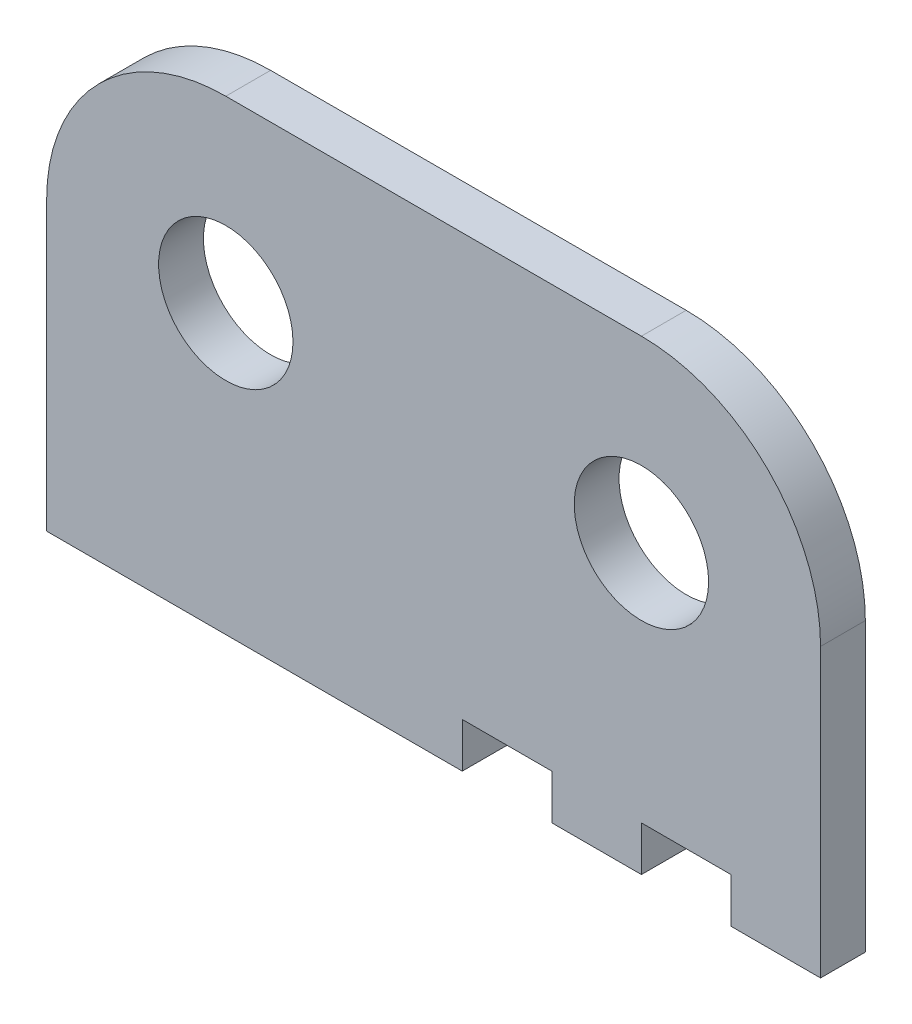
ISO-10303-21;
HEADER;
FILE_DESCRIPTION(('STEP AP214'),'2;1');
FILE_NAME('part.step','',(''),(''),'','','');
FILE_SCHEMA(('AUTOMOTIVE_DESIGN { 1 0 10303 214 1 1 1 1 }'));
ENDSEC;
DATA;
#1=APPLICATION_CONTEXT('core data for automotive mechanical design processes');
#2=APPLICATION_PROTOCOL_DEFINITION('international standard','automotive_design',2000,#1);
#3=PRODUCT_CONTEXT('',#1,'mechanical');
#4=PRODUCT('Part','Part','',(#3));
#5=PRODUCT_RELATED_PRODUCT_CATEGORY('part','',(#4));
#6=PRODUCT_DEFINITION_FORMATION('','',#4);
#7=PRODUCT_DEFINITION_CONTEXT('part definition',#1,'design');
#8=PRODUCT_DEFINITION('design','',#6,#7);
#9=PRODUCT_DEFINITION_SHAPE('','',#8);
#10=(LENGTH_UNIT() NAMED_UNIT(*) SI_UNIT(.MILLI.,.METRE.));
#11=(NAMED_UNIT(*) PLANE_ANGLE_UNIT() SI_UNIT($,.RADIAN.));
#12=(NAMED_UNIT(*) SI_UNIT($,.STERADIAN.) SOLID_ANGLE_UNIT());
#13=UNCERTAINTY_MEASURE_WITH_UNIT(LENGTH_MEASURE(1.E-05),#10,'distance_accuracy_value','');
#14=(GEOMETRIC_REPRESENTATION_CONTEXT(3) GLOBAL_UNCERTAINTY_ASSIGNED_CONTEXT((#13)) GLOBAL_UNIT_ASSIGNED_CONTEXT((#10,
#11,#12)) REPRESENTATION_CONTEXT('',''));
#15=CARTESIAN_POINT('',(0.,0.,0.));
#16=DIRECTION('',(0.,0.,1.));
#17=DIRECTION('',(1.,0.,0.));
#18=AXIS2_PLACEMENT_3D('',#15,#16,#17);
#19=CARTESIAN_POINT('',(-21.4763243575419,0.,3.175));
#20=DIRECTION('',(0.,1.,0.));
#21=DIRECTION('',(0.,0.,1.));
#22=AXIS2_PLACEMENT_3D('',#19,#20,#21);
#23=PLANE('',#22);
#24=DIRECTION('',(1.,0.,0.));
#25=VECTOR('',#24,1.);
#26=CARTESIAN_POINT('',(-21.4763243575419,0.,0.));
#27=LINE('',#26,#25);
#28=CARTESIAN_POINT('',(14.3376756424581,0.,0.));
#29=VERTEX_POINT('',#28);
#30=CARTESIAN_POINT('',(20.6876756424581,0.,0.));
#31=VERTEX_POINT('',#30);
#32=EDGE_CURVE('E285',#29,#31,#27,.T.);
#33=ORIENTED_EDGE('',*,*,#32,.T.);
#34=DIRECTION('',(0.,0.,-1.));
#35=VECTOR('',#34,1.);
#36=CARTESIAN_POINT('',(20.6876756424581,0.,0.));
#37=LINE('',#36,#35);
#38=CARTESIAN_POINT('',(20.6876756424581,0.,3.175));
#39=VERTEX_POINT('',#38);
#40=EDGE_CURVE('E150',#39,#31,#37,.T.);
#41=ORIENTED_EDGE('',*,*,#40,.F.);
#42=DIRECTION('',(1.,0.,0.));
#43=VECTOR('',#42,1.);
#44=CARTESIAN_POINT('',(-21.4763243575419,0.,3.175));
#45=LINE('',#44,#43);
#46=CARTESIAN_POINT('',(14.3376756424581,0.,3.175));
#47=VERTEX_POINT('',#46);
#48=EDGE_CURVE('E264',#47,#39,#45,.T.);
#49=ORIENTED_EDGE('',*,*,#48,.F.);
#50=DIRECTION('',(0.,0.,1.));
#51=VECTOR('',#50,1.);
#52=CARTESIAN_POINT('',(14.3376756424581,0.,3.175));
#53=LINE('',#52,#51);
#54=EDGE_CURVE('E208',#29,#47,#53,.T.);
#55=ORIENTED_EDGE('',*,*,#54,.F.);
#56=EDGE_LOOP('',(#33,#41,#49,#55));
#57=FACE_BOUND('',#56,.T.);
#58=ADVANCED_FACE('F43',(#57),#23,.F.);
#59=CARTESIAN_POINT('',(-21.4763243575419,0.,0.));
#60=VERTEX_POINT('',#59);
#61=CARTESIAN_POINT('',(7.9876756424581,0.,0.));
#62=VERTEX_POINT('',#61);
#63=EDGE_CURVE('E281',#60,#62,#27,.T.);
#64=ORIENTED_EDGE('',*,*,#63,.T.);
#65=DIRECTION('',(0.,0.,-1.));
#66=VECTOR('',#65,1.);
#67=CARTESIAN_POINT('',(7.9876756424581,0.,3.175));
#68=LINE('',#67,#66);
#69=CARTESIAN_POINT('',(7.9876756424581,0.,3.175));
#70=VERTEX_POINT('',#69);
#71=EDGE_CURVE('E181',#70,#62,#68,.T.);
#72=ORIENTED_EDGE('',*,*,#71,.F.);
#73=CARTESIAN_POINT('',(-21.4763243575419,0.,3.175));
#74=VERTEX_POINT('',#73);
#75=EDGE_CURVE('E259',#74,#70,#45,.T.);
#76=ORIENTED_EDGE('',*,*,#75,.F.);
#77=DIRECTION('',(0.,0.,-1.));
#78=VECTOR('',#77,1.);
#79=CARTESIAN_POINT('',(-21.4763243575419,0.,3.175));
#80=LINE('',#79,#78);
#81=EDGE_CURVE('E295',#74,#60,#80,.T.);
#82=ORIENTED_EDGE('',*,*,#81,.T.);
#83=EDGE_LOOP('',(#64,#72,#76,#82));
#84=FACE_BOUND('',#83,.T.);
#85=ADVANCED_FACE('F320',(#84),#23,.F.);
#86=CARTESIAN_POINT('',(20.6876756424581,20.35683,3.175));
#87=DIRECTION('',(0.,0.,1.));
#88=DIRECTION('',(1.,0.,0.));
#89=AXIS2_PLACEMENT_3D('',#86,#87,#88);
#90=PLANE('',#89);
#91=DIRECTION('',(0.,-1.,0.));
#92=VECTOR('',#91,1.);
#93=CARTESIAN_POINT('',(20.6876756424581,3.175,3.175));
#94=LINE('',#93,#92);
#95=CARTESIAN_POINT('',(20.6876756424581,3.175,3.175));
#96=VERTEX_POINT('',#95);
#97=EDGE_CURVE('E184',#96,#39,#94,.T.);
#98=ORIENTED_EDGE('',*,*,#97,.F.);
#99=DIRECTION('',(-1.,0.,0.));
#100=VECTOR('',#99,1.);
#101=CARTESIAN_POINT('',(20.6876756424581,3.175,3.175));
#102=LINE('',#101,#100);
#103=CARTESIAN_POINT('',(27.0376756424581,3.175,3.175));
#104=VERTEX_POINT('',#103);
#105=EDGE_CURVE('E156',#104,#96,#102,.T.);
#106=ORIENTED_EDGE('',*,*,#105,.F.);
#107=DIRECTION('',(0.,-1.,0.));
#108=VECTOR('',#107,1.);
#109=CARTESIAN_POINT('',(27.0376756424581,3.175,3.175));
#110=LINE('',#109,#108);
#111=CARTESIAN_POINT('',(27.0376756424581,0.,3.175));
#112=VERTEX_POINT('',#111);
#113=EDGE_CURVE('E188',#104,#112,#110,.T.);
#114=ORIENTED_EDGE('',*,*,#113,.T.);
#115=CARTESIAN_POINT('',(33.3876756424581,0.,3.175));
#116=VERTEX_POINT('',#115);
#117=EDGE_CURVE('E258',#112,#116,#45,.T.);
#118=ORIENTED_EDGE('',*,*,#117,.T.);
#119=DIRECTION('',(0.,1.,0.));
#120=VECTOR('',#119,1.);
#121=CARTESIAN_POINT('',(33.3876756424581,20.35683,3.175));
#122=LINE('',#121,#120);
#123=CARTESIAN_POINT('',(33.3876756424581,20.35683,3.175));
#124=VERTEX_POINT('',#123);
#125=EDGE_CURVE('E263',#116,#124,#122,.T.);
#126=ORIENTED_EDGE('',*,*,#125,.T.);
#127=CARTESIAN_POINT('',(20.6876756424581,20.35683,3.175));
#128=DIRECTION('',(0.,0.,1.));
#129=DIRECTION('',(1.,0.,0.));
#130=AXIS2_PLACEMENT_3D('',#127,#128,#129);
#131=CIRCLE('',#130,12.7);
#132=CARTESIAN_POINT('',(20.6876756424581,33.05683,3.175));
#133=VERTEX_POINT('',#132);
#134=EDGE_CURVE('E244',#124,#133,#131,.T.);
#135=ORIENTED_EDGE('',*,*,#134,.T.);
#136=DIRECTION('',(-1.,0.,0.));
#137=VECTOR('',#136,1.);
#138=CARTESIAN_POINT('',(20.6876756424581,33.05683,3.175));
#139=LINE('',#138,#137);
#140=CARTESIAN_POINT('',(-8.77632435754189,33.05683,3.175));
#141=VERTEX_POINT('',#140);
#142=EDGE_CURVE('E248',#133,#141,#139,.T.);
#143=ORIENTED_EDGE('',*,*,#142,.T.);
#144=CARTESIAN_POINT('',(-8.77632435754189,20.35683,3.175));
#145=DIRECTION('',(0.,0.,1.));
#146=DIRECTION('',(1.,0.,0.));
#147=AXIS2_PLACEMENT_3D('',#144,#145,#146);
#148=CIRCLE('',#147,12.7);
#149=CARTESIAN_POINT('',(-21.4763243575419,20.35683,3.175));
#150=VERTEX_POINT('',#149);
#151=EDGE_CURVE('E252',#141,#150,#148,.T.);
#152=ORIENTED_EDGE('',*,*,#151,.T.);
#153=DIRECTION('',(0.,-1.,0.));
#154=VECTOR('',#153,1.);
#155=CARTESIAN_POINT('',(-21.4763243575419,20.35683,3.175));
#156=LINE('',#155,#154);
#157=EDGE_CURVE('E255',#150,#74,#156,.T.);
#158=ORIENTED_EDGE('',*,*,#157,.T.);
#159=ORIENTED_EDGE('',*,*,#75,.T.);
#160=DIRECTION('',(0.,-1.,0.));
#161=VECTOR('',#160,1.);
#162=CARTESIAN_POINT('',(7.9876756424581,3.175,3.175));
#163=LINE('',#162,#161);
#164=CARTESIAN_POINT('',(7.9876756424581,3.175,3.175));
#165=VERTEX_POINT('',#164);
#166=EDGE_CURVE('E205',#165,#70,#163,.T.);
#167=ORIENTED_EDGE('',*,*,#166,.F.);
#168=DIRECTION('',(-1.,0.,0.));
#169=VECTOR('',#168,1.);
#170=CARTESIAN_POINT('',(7.9876756424581,3.175,3.175));
#171=LINE('',#170,#169);
#172=CARTESIAN_POINT('',(14.3376756424581,3.175,3.175));
#173=VERTEX_POINT('',#172);
#174=EDGE_CURVE('E198',#173,#165,#171,.T.);
#175=ORIENTED_EDGE('',*,*,#174,.F.);
#176=DIRECTION('',(0.,-1.,0.));
#177=VECTOR('',#176,1.);
#178=CARTESIAN_POINT('',(14.3376756424581,3.175,3.175));
#179=LINE('',#178,#177);
#180=EDGE_CURVE('E201',#173,#47,#179,.T.);
#181=ORIENTED_EDGE('',*,*,#180,.T.);
#182=ORIENTED_EDGE('',*,*,#48,.T.);
#183=EDGE_LOOP('',(#98,#106,#114,#118,#126,#135,#143,#152,#158,#159,#167,#175,#181,#182));
#184=FACE_BOUND('',#183,.T.);
#185=CARTESIAN_POINT('',(20.6876756424581,20.35683,3.175));
#186=DIRECTION('',(0.,0.,1.));
#187=DIRECTION('',(1.,0.,0.));
#188=AXIS2_PLACEMENT_3D('',#185,#186,#187);
#189=CIRCLE('',#188,4.7625);
#190=CARTESIAN_POINT('',(25.4501756424581,20.35683,3.175));
#191=VERTEX_POINT('',#190);
#192=EDGE_CURVE('E236',#191,#191,#189,.T.);
#193=ORIENTED_EDGE('',*,*,#192,.F.);
#194=EDGE_LOOP('',(#193));
#195=FACE_BOUND('',#194,.T.);
#196=CARTESIAN_POINT('',(-8.77632435754189,20.35683,3.175));
#197=DIRECTION('',(0.,0.,1.));
#198=DIRECTION('',(1.,0.,0.));
#199=AXIS2_PLACEMENT_3D('',#196,#197,#198);
#200=CIRCLE('',#199,4.7625);
#201=CARTESIAN_POINT('',(-4.01382435754189,20.35683,3.175));
#202=VERTEX_POINT('',#201);
#203=EDGE_CURVE('E228',#202,#202,#200,.T.);
#204=ORIENTED_EDGE('',*,*,#203,.F.);
#205=EDGE_LOOP('',(#204));
#206=FACE_BOUND('',#205,.T.);
#207=ADVANCED_FACE('F324',(#184,#195,#206),#90,.T.);
#208=CARTESIAN_POINT('',(20.6876756424581,20.35683,0.));
#209=DIRECTION('',(0.,0.,1.));
#210=DIRECTION('',(1.,0.,0.));
#211=AXIS2_PLACEMENT_3D('',#208,#209,#210);
#212=PLANE('',#211);
#213=DIRECTION('',(1.,0.,0.));
#214=VECTOR('',#213,1.);
#215=CARTESIAN_POINT('',(20.6876756424581,3.175,0.));
#216=LINE('',#215,#214);
#217=CARTESIAN_POINT('',(20.6876756424581,3.175,0.));
#218=VERTEX_POINT('',#217);
#219=CARTESIAN_POINT('',(27.0376756424581,3.175,0.));
#220=VERTEX_POINT('',#219);
#221=EDGE_CURVE('E162',#218,#220,#216,.T.);
#222=ORIENTED_EDGE('',*,*,#221,.F.);
#223=DIRECTION('',(0.,-1.,0.));
#224=VECTOR('',#223,1.);
#225=CARTESIAN_POINT('',(20.6876756424581,3.175,0.));
#226=LINE('',#225,#224);
#227=EDGE_CURVE('E144',#218,#31,#226,.T.);
#228=ORIENTED_EDGE('',*,*,#227,.T.);
#229=ORIENTED_EDGE('',*,*,#32,.F.);
#230=DIRECTION('',(0.,-1.,0.));
#231=VECTOR('',#230,1.);
#232=CARTESIAN_POINT('',(14.3376756424581,3.175,0.));
#233=LINE('',#232,#231);
#234=CARTESIAN_POINT('',(14.3376756424581,3.175,0.));
#235=VERTEX_POINT('',#234);
#236=EDGE_CURVE('E67',#235,#29,#233,.T.);
#237=ORIENTED_EDGE('',*,*,#236,.F.);
#238=DIRECTION('',(1.,0.,0.));
#239=VECTOR('',#238,1.);
#240=CARTESIAN_POINT('',(7.9876756424581,3.175,0.));
#241=LINE('',#240,#239);
#242=CARTESIAN_POINT('',(7.9876756424581,3.175,0.));
#243=VERTEX_POINT('',#242);
#244=EDGE_CURVE('E221',#243,#235,#241,.T.);
#245=ORIENTED_EDGE('',*,*,#244,.F.);
#246=DIRECTION('',(0.,-1.,0.));
#247=VECTOR('',#246,1.);
#248=CARTESIAN_POINT('',(7.9876756424581,3.175,0.));
#249=LINE('',#248,#247);
#250=EDGE_CURVE('E194',#243,#62,#249,.T.);
#251=ORIENTED_EDGE('',*,*,#250,.T.);
#252=ORIENTED_EDGE('',*,*,#63,.F.);
#253=DIRECTION('',(0.,-1.,0.));
#254=VECTOR('',#253,1.);
#255=CARTESIAN_POINT('',(-21.4763243575419,20.35683,0.));
#256=LINE('',#255,#254);
#257=CARTESIAN_POINT('',(-21.4763243575419,20.35683,0.));
#258=VERTEX_POINT('',#257);
#259=EDGE_CURVE('E277',#258,#60,#256,.T.);
#260=ORIENTED_EDGE('',*,*,#259,.F.);
#261=CARTESIAN_POINT('',(-8.77632435754189,20.35683,0.));
#262=DIRECTION('',(0.,0.,1.));
#263=DIRECTION('',(1.,0.,0.));
#264=AXIS2_PLACEMENT_3D('',#261,#262,#263);
#265=CIRCLE('',#264,12.7);
#266=CARTESIAN_POINT('',(-8.77632435754189,33.05683,0.));
#267=VERTEX_POINT('',#266);
#268=EDGE_CURVE('E274',#267,#258,#265,.T.);
#269=ORIENTED_EDGE('',*,*,#268,.F.);
#270=DIRECTION('',(-1.,0.,0.));
#271=VECTOR('',#270,1.);
#272=CARTESIAN_POINT('',(20.6876756424581,33.05683,0.));
#273=LINE('',#272,#271);
#274=CARTESIAN_POINT('',(20.6876756424581,33.05683,0.));
#275=VERTEX_POINT('',#274);
#276=EDGE_CURVE('E271',#275,#267,#273,.T.);
#277=ORIENTED_EDGE('',*,*,#276,.F.);
#278=CARTESIAN_POINT('',(20.6876756424581,20.35683,0.));
#279=DIRECTION('',(0.,0.,1.));
#280=DIRECTION('',(1.,0.,0.));
#281=AXIS2_PLACEMENT_3D('',#278,#279,#280);
#282=CIRCLE('',#281,12.7);
#283=CARTESIAN_POINT('',(33.3876756424581,20.35683,0.));
#284=VERTEX_POINT('',#283);
#285=EDGE_CURVE('E240',#284,#275,#282,.T.);
#286=ORIENTED_EDGE('',*,*,#285,.F.);
#287=DIRECTION('',(0.,1.,0.));
#288=VECTOR('',#287,1.);
#289=CARTESIAN_POINT('',(33.3876756424581,20.35683,0.));
#290=LINE('',#289,#288);
#291=CARTESIAN_POINT('',(33.3876756424581,0.,0.));
#292=VERTEX_POINT('',#291);
#293=EDGE_CURVE('E249',#292,#284,#290,.T.);
#294=ORIENTED_EDGE('',*,*,#293,.F.);
#295=CARTESIAN_POINT('',(27.0376756424581,0.,0.));
#296=VERTEX_POINT('',#295);
#297=EDGE_CURVE('E280',#296,#292,#27,.T.);
#298=ORIENTED_EDGE('',*,*,#297,.F.);
#299=DIRECTION('',(0.,-1.,0.));
#300=VECTOR('',#299,1.);
#301=CARTESIAN_POINT('',(27.0376756424581,3.175,0.));
#302=LINE('',#301,#300);
#303=EDGE_CURVE('E59',#220,#296,#302,.T.);
#304=ORIENTED_EDGE('',*,*,#303,.F.);
#305=EDGE_LOOP('',(#222,#228,#229,#237,#245,#251,#252,#260,#269,#277,#286,#294,#298,#304));
#306=FACE_BOUND('',#305,.T.);
#307=CARTESIAN_POINT('',(20.6876756424581,20.35683,0.));
#308=DIRECTION('',(0.,0.,1.));
#309=DIRECTION('',(1.,0.,0.));
#310=AXIS2_PLACEMENT_3D('',#307,#308,#309);
#311=CIRCLE('',#310,4.7625);
#312=CARTESIAN_POINT('',(25.4501756424581,20.35683,0.));
#313=VERTEX_POINT('',#312);
#314=EDGE_CURVE('E232',#313,#313,#311,.T.);
#315=ORIENTED_EDGE('',*,*,#314,.T.);
#316=EDGE_LOOP('',(#315));
#317=FACE_BOUND('',#316,.T.);
#318=CARTESIAN_POINT('',(-8.77632435754189,20.35683,0.));
#319=DIRECTION('',(0.,0.,1.));
#320=DIRECTION('',(1.,0.,0.));
#321=AXIS2_PLACEMENT_3D('',#318,#319,#320);
#322=CIRCLE('',#321,4.7625);
#323=CARTESIAN_POINT('',(-4.01382435754189,20.35683,0.));
#324=VERTEX_POINT('',#323);
#325=EDGE_CURVE('E187',#324,#324,#322,.T.);
#326=ORIENTED_EDGE('',*,*,#325,.T.);
#327=EDGE_LOOP('',(#326));
#328=FACE_BOUND('',#327,.T.);
#329=ADVANCED_FACE('F168',(#306,#317,#328),#212,.F.);
#330=CARTESIAN_POINT('',(20.6876756424581,20.35683,3.175));
#331=DIRECTION('',(0.,0.,-1.));
#332=DIRECTION('',(-1.,0.,0.));
#333=AXIS2_PLACEMENT_3D('',#330,#331,#332);
#334=CYLINDRICAL_SURFACE('',#333,12.7);
#335=ORIENTED_EDGE('',*,*,#285,.T.);
#336=DIRECTION('',(0.,0.,-1.));
#337=VECTOR('',#336,1.);
#338=CARTESIAN_POINT('',(20.6876756424581,33.05683,3.175));
#339=LINE('',#338,#337);
#340=EDGE_CURVE('E11',#133,#275,#339,.T.);
#341=ORIENTED_EDGE('',*,*,#340,.F.);
#342=ORIENTED_EDGE('',*,*,#134,.F.);
#343=DIRECTION('',(0.,0.,-1.));
#344=VECTOR('',#343,1.);
#345=CARTESIAN_POINT('',(33.3876756424581,20.35683,3.175));
#346=LINE('',#345,#344);
#347=EDGE_CURVE('E267',#124,#284,#346,.T.);
#348=ORIENTED_EDGE('',*,*,#347,.T.);
#349=EDGE_LOOP('',(#335,#341,#342,#348));
#350=FACE_BOUND('',#349,.T.);
#351=ADVANCED_FACE('F45',(#350),#334,.T.);
#352=CARTESIAN_POINT('',(20.6876756424581,33.05683,3.175));
#353=DIRECTION('',(0.,-1.,0.));
#354=DIRECTION('',(0.,0.,-1.));
#355=AXIS2_PLACEMENT_3D('',#352,#353,#354);
#356=PLANE('',#355);
#357=ORIENTED_EDGE('',*,*,#276,.T.);
#358=DIRECTION('',(0.,0.,-1.));
#359=VECTOR('',#358,1.);
#360=CARTESIAN_POINT('',(-8.77632435754189,33.05683,3.175));
#361=LINE('',#360,#359);
#362=EDGE_CURVE('E52',#141,#267,#361,.T.);
#363=ORIENTED_EDGE('',*,*,#362,.F.);
#364=ORIENTED_EDGE('',*,*,#142,.F.);
#365=ORIENTED_EDGE('',*,*,#340,.T.);
#366=EDGE_LOOP('',(#357,#363,#364,#365));
#367=FACE_BOUND('',#366,.T.);
#368=ADVANCED_FACE('F329',(#367),#356,.F.);
#369=CARTESIAN_POINT('',(-8.77632435754189,20.35683,3.175));
#370=DIRECTION('',(0.,0.,-1.));
#371=DIRECTION('',(-1.,0.,0.));
#372=AXIS2_PLACEMENT_3D('',#369,#370,#371);
#373=CYLINDRICAL_SURFACE('',#372,12.7);
#374=ORIENTED_EDGE('',*,*,#268,.T.);
#375=DIRECTION('',(0.,0.,-1.));
#376=VECTOR('',#375,1.);
#377=CARTESIAN_POINT('',(-21.4763243575419,20.35683,3.175));
#378=LINE('',#377,#376);
#379=EDGE_CURVE('E299',#150,#258,#378,.T.);
#380=ORIENTED_EDGE('',*,*,#379,.F.);
#381=ORIENTED_EDGE('',*,*,#151,.F.);
#382=ORIENTED_EDGE('',*,*,#362,.T.);
#383=EDGE_LOOP('',(#374,#380,#381,#382));
#384=FACE_BOUND('',#383,.T.);
#385=ADVANCED_FACE('F308',(#384),#373,.T.);
#386=CARTESIAN_POINT('',(-21.4763243575419,20.35683,3.175));
#387=DIRECTION('',(1.,0.,0.));
#388=DIRECTION('',(0.,1.,0.));
#389=AXIS2_PLACEMENT_3D('',#386,#387,#388);
#390=PLANE('',#389);
#391=ORIENTED_EDGE('',*,*,#259,.T.);
#392=ORIENTED_EDGE('',*,*,#81,.F.);
#393=ORIENTED_EDGE('',*,*,#157,.F.);
#394=ORIENTED_EDGE('',*,*,#379,.T.);
#395=EDGE_LOOP('',(#391,#392,#393,#394));
#396=FACE_BOUND('',#395,.T.);
#397=ADVANCED_FACE('F316',(#396),#390,.F.);
#398=ORIENTED_EDGE('',*,*,#117,.F.);
#399=DIRECTION('',(0.,0.,1.));
#400=VECTOR('',#399,1.);
#401=CARTESIAN_POINT('',(27.0376756424581,0.,0.));
#402=LINE('',#401,#400);
#403=EDGE_CURVE('E166',#296,#112,#402,.T.);
#404=ORIENTED_EDGE('',*,*,#403,.F.);
#405=ORIENTED_EDGE('',*,*,#297,.T.);
#406=DIRECTION('',(0.,0.,-1.));
#407=VECTOR('',#406,1.);
#408=CARTESIAN_POINT('',(33.3876756424581,0.,3.175));
#409=LINE('',#408,#407);
#410=EDGE_CURVE('E291',#116,#292,#409,.T.);
#411=ORIENTED_EDGE('',*,*,#410,.F.);
#412=EDGE_LOOP('',(#398,#404,#405,#411));
#413=FACE_BOUND('',#412,.T.);
#414=ADVANCED_FACE('F339',(#413),#23,.F.);
#415=CARTESIAN_POINT('',(33.3876756424581,20.35683,3.175));
#416=DIRECTION('',(-1.,0.,0.));
#417=DIRECTION('',(0.,0.,1.));
#418=AXIS2_PLACEMENT_3D('',#415,#416,#417);
#419=PLANE('',#418);
#420=ORIENTED_EDGE('',*,*,#293,.T.);
#421=ORIENTED_EDGE('',*,*,#347,.F.);
#422=ORIENTED_EDGE('',*,*,#125,.F.);
#423=ORIENTED_EDGE('',*,*,#410,.T.);
#424=EDGE_LOOP('',(#420,#421,#422,#423));
#425=FACE_BOUND('',#424,.T.);
#426=ADVANCED_FACE('F334',(#425),#419,.F.);
#427=CARTESIAN_POINT('',(20.6876756424581,20.35683,3.175));
#428=DIRECTION('',(0.,0.,-1.));
#429=DIRECTION('',(-1.,0.,0.));
#430=AXIS2_PLACEMENT_3D('',#427,#428,#429);
#431=CYLINDRICAL_SURFACE('',#430,4.7625);
#432=ORIENTED_EDGE('',*,*,#192,.T.);
#433=EDGE_LOOP('',(#432));
#434=FACE_BOUND('',#433,.T.);
#435=ORIENTED_EDGE('',*,*,#314,.F.);
#436=EDGE_LOOP('',(#435));
#437=FACE_BOUND('',#436,.T.);
#438=ADVANCED_FACE('F359',(#434,#437),#431,.F.);
#439=CARTESIAN_POINT('',(-8.77632435754189,20.35683,3.175));
#440=DIRECTION('',(0.,0.,-1.));
#441=DIRECTION('',(-1.,0.,0.));
#442=AXIS2_PLACEMENT_3D('',#439,#440,#441);
#443=CYLINDRICAL_SURFACE('',#442,4.7625);
#444=ORIENTED_EDGE('',*,*,#203,.T.);
#445=EDGE_LOOP('',(#444));
#446=FACE_BOUND('',#445,.T.);
#447=ORIENTED_EDGE('',*,*,#325,.F.);
#448=EDGE_LOOP('',(#447));
#449=FACE_BOUND('',#448,.T.);
#450=ADVANCED_FACE('F352',(#446,#449),#443,.F.);
#451=CARTESIAN_POINT('',(7.9876756424581,3.175,3.175));
#452=DIRECTION('',(-1.,0.,0.));
#453=DIRECTION('',(0.,0.,1.));
#454=AXIS2_PLACEMENT_3D('',#451,#452,#453);
#455=PLANE('',#454);
#456=ORIENTED_EDGE('',*,*,#71,.T.);
#457=ORIENTED_EDGE('',*,*,#250,.F.);
#458=DIRECTION('',(0.,0.,-1.));
#459=VECTOR('',#458,1.);
#460=CARTESIAN_POINT('',(7.9876756424581,3.175,3.175));
#461=LINE('',#460,#459);
#462=EDGE_CURVE('E211',#165,#243,#461,.T.);
#463=ORIENTED_EDGE('',*,*,#462,.F.);
#464=ORIENTED_EDGE('',*,*,#166,.T.);
#465=EDGE_LOOP('',(#456,#457,#463,#464));
#466=FACE_BOUND('',#465,.T.);
#467=ADVANCED_FACE('F349',(#466),#455,.F.);
#468=CARTESIAN_POINT('',(14.3376756424581,3.175,3.175));
#469=DIRECTION('',(1.,0.,0.));
#470=DIRECTION('',(0.,0.,-1.));
#471=AXIS2_PLACEMENT_3D('',#468,#469,#470);
#472=PLANE('',#471);
#473=ORIENTED_EDGE('',*,*,#54,.T.);
#474=ORIENTED_EDGE('',*,*,#180,.F.);
#475=DIRECTION('',(0.,0.,1.));
#476=VECTOR('',#475,1.);
#477=CARTESIAN_POINT('',(14.3376756424581,3.175,3.175));
#478=LINE('',#477,#476);
#479=EDGE_CURVE('E217',#235,#173,#478,.T.);
#480=ORIENTED_EDGE('',*,*,#479,.F.);
#481=ORIENTED_EDGE('',*,*,#236,.T.);
#482=EDGE_LOOP('',(#473,#474,#480,#481));
#483=FACE_BOUND('',#482,.T.);
#484=ADVANCED_FACE('F351',(#483),#472,.F.);
#485=CARTESIAN_POINT('',(0.,3.175,0.));
#486=DIRECTION('',(0.,-1.,0.));
#487=DIRECTION('',(0.,0.,-1.));
#488=AXIS2_PLACEMENT_3D('',#485,#486,#487);
#489=PLANE('',#488);
#490=ORIENTED_EDGE('',*,*,#462,.T.);
#491=ORIENTED_EDGE('',*,*,#244,.T.);
#492=ORIENTED_EDGE('',*,*,#479,.T.);
#493=ORIENTED_EDGE('',*,*,#174,.T.);
#494=EDGE_LOOP('',(#490,#491,#492,#493));
#495=FACE_BOUND('',#494,.T.);
#496=ADVANCED_FACE('F347',(#495),#489,.T.);
#497=CARTESIAN_POINT('',(20.6876756424581,3.175,0.));
#498=DIRECTION('',(-1.,0.,0.));
#499=DIRECTION('',(0.,0.,1.));
#500=AXIS2_PLACEMENT_3D('',#497,#498,#499);
#501=PLANE('',#500);
#502=ORIENTED_EDGE('',*,*,#40,.T.);
#503=ORIENTED_EDGE('',*,*,#227,.F.);
#504=DIRECTION('',(0.,0.,-1.));
#505=VECTOR('',#504,1.);
#506=CARTESIAN_POINT('',(20.6876756424581,3.175,0.));
#507=LINE('',#506,#505);
#508=EDGE_CURVE('E147',#96,#218,#507,.T.);
#509=ORIENTED_EDGE('',*,*,#508,.F.);
#510=ORIENTED_EDGE('',*,*,#97,.T.);
#511=EDGE_LOOP('',(#502,#503,#509,#510));
#512=FACE_BOUND('',#511,.T.);
#513=ADVANCED_FACE('F146',(#512),#501,.F.);
#514=CARTESIAN_POINT('',(27.0376756424581,3.175,0.));
#515=DIRECTION('',(1.,0.,0.));
#516=DIRECTION('',(0.,0.,-1.));
#517=AXIS2_PLACEMENT_3D('',#514,#515,#516);
#518=PLANE('',#517);
#519=ORIENTED_EDGE('',*,*,#403,.T.);
#520=ORIENTED_EDGE('',*,*,#113,.F.);
#521=DIRECTION('',(0.,0.,1.));
#522=VECTOR('',#521,1.);
#523=CARTESIAN_POINT('',(27.0376756424581,3.175,0.));
#524=LINE('',#523,#522);
#525=EDGE_CURVE('E172',#220,#104,#524,.T.);
#526=ORIENTED_EDGE('',*,*,#525,.F.);
#527=ORIENTED_EDGE('',*,*,#303,.T.);
#528=EDGE_LOOP('',(#519,#520,#526,#527));
#529=FACE_BOUND('',#528,.T.);
#530=ADVANCED_FACE('F399',(#529),#518,.F.);
#531=CARTESIAN_POINT('',(0.,3.175,0.));
#532=DIRECTION('',(0.,1.,0.));
#533=DIRECTION('',(0.,0.,1.));
#534=AXIS2_PLACEMENT_3D('',#531,#532,#533);
#535=PLANE('',#534);
#536=ORIENTED_EDGE('',*,*,#508,.T.);
#537=ORIENTED_EDGE('',*,*,#221,.T.);
#538=ORIENTED_EDGE('',*,*,#525,.T.);
#539=ORIENTED_EDGE('',*,*,#105,.T.);
#540=EDGE_LOOP('',(#536,#537,#538,#539));
#541=FACE_BOUND('',#540,.T.);
#542=ADVANCED_FACE('F160',(#541),#535,.F.);
#543=CLOSED_SHELL('',(#58,#85,#207,#329,#351,#368,#385,#397,#414,#426,#438,#450,#467,#484,#496,
#513,#530,#542));
#544=MANIFOLD_SOLID_BREP('B2',#543);
#545=ADVANCED_BREP_SHAPE_REPRESENTATION('',(#18,#544),#14);
#546=SHAPE_DEFINITION_REPRESENTATION(#9,#545);
ENDSEC;
END-ISO-10303-21;
